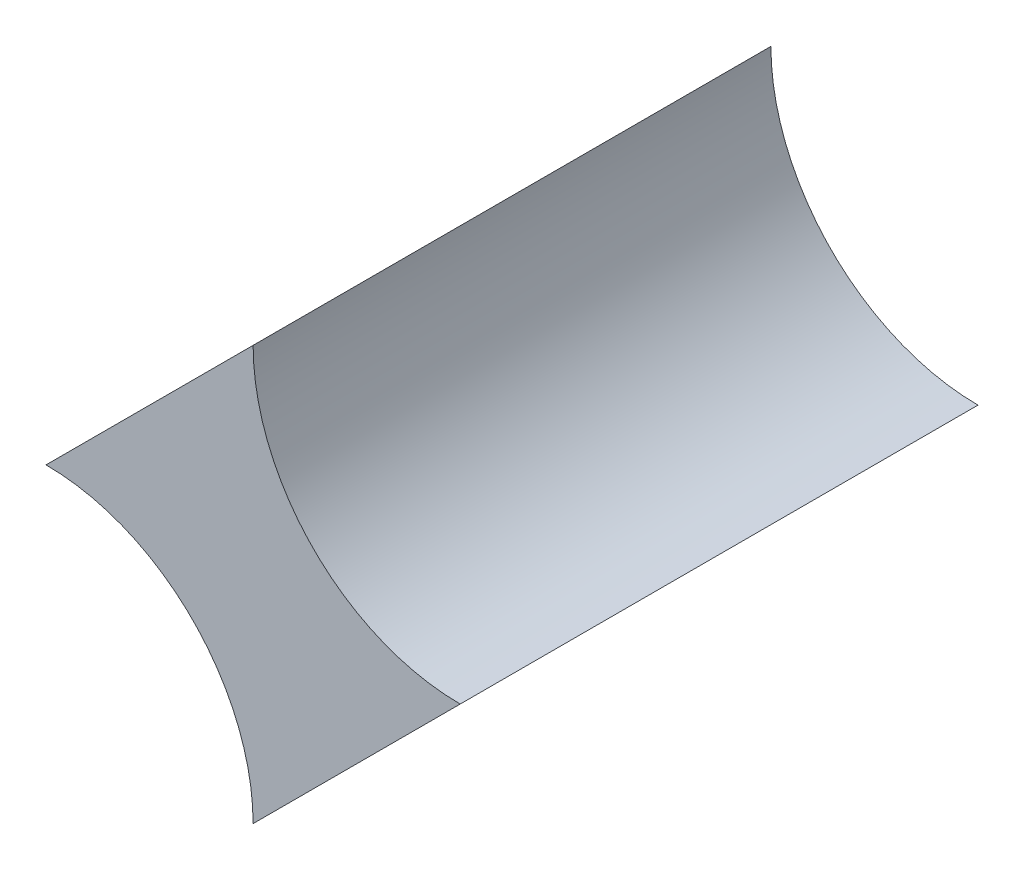
ISO-10303-21;
HEADER;
FILE_DESCRIPTION(('STEP AP214'),'2;1');
FILE_NAME('part.step','',(''),(''),'','','');
FILE_SCHEMA(('AUTOMOTIVE_DESIGN { 1 0 10303 214 1 1 1 1 }'));
ENDSEC;
DATA;
#1=APPLICATION_CONTEXT('core data for automotive mechanical design processes');
#2=APPLICATION_PROTOCOL_DEFINITION('international standard','automotive_design',2000,#1);
#3=PRODUCT_CONTEXT('',#1,'mechanical');
#4=PRODUCT('Part','Part','',(#3));
#5=PRODUCT_RELATED_PRODUCT_CATEGORY('part','',(#4));
#6=PRODUCT_DEFINITION_FORMATION('','',#4);
#7=PRODUCT_DEFINITION_CONTEXT('part definition',#1,'design');
#8=PRODUCT_DEFINITION('design','',#6,#7);
#9=PRODUCT_DEFINITION_SHAPE('','',#8);
#10=(LENGTH_UNIT() NAMED_UNIT(*) SI_UNIT(.MILLI.,.METRE.));
#11=(NAMED_UNIT(*) PLANE_ANGLE_UNIT() SI_UNIT($,.RADIAN.));
#12=(NAMED_UNIT(*) SI_UNIT($,.STERADIAN.) SOLID_ANGLE_UNIT());
#13=UNCERTAINTY_MEASURE_WITH_UNIT(LENGTH_MEASURE(1.E-05),#10,'distance_accuracy_value','');
#14=(GEOMETRIC_REPRESENTATION_CONTEXT(3) GLOBAL_UNCERTAINTY_ASSIGNED_CONTEXT((#13)) GLOBAL_UNIT_ASSIGNED_CONTEXT((#10,
#11,#12)) REPRESENTATION_CONTEXT('',''));
#15=CARTESIAN_POINT('',(0.,0.,0.));
#16=DIRECTION('',(0.,0.,1.));
#17=DIRECTION('',(1.,0.,0.));
#18=AXIS2_PLACEMENT_3D('',#15,#16,#17);
#19=CARTESIAN_POINT('',(-20.,-10.,25.));
#20=DIRECTION('',(0.,0.,-1.));
#21=DIRECTION('',(-1.,0.,0.));
#22=AXIS2_PLACEMENT_3D('',#19,#20,#21);
#23=CYLINDRICAL_SURFACE('',#22,10.);
#24=CARTESIAN_POINT('',(-20.,-10.,0.));
#25=DIRECTION('',(0.,0.,-1.));
#26=DIRECTION('',(-1.,0.,0.));
#27=AXIS2_PLACEMENT_3D('',#24,#25,#26);
#28=CIRCLE('',#27,10.);
#29=CARTESIAN_POINT('',(-20.,0.,0.));
#30=VERTEX_POINT('',#29);
#31=CARTESIAN_POINT('',(-10.,-10.,0.));
#32=VERTEX_POINT('',#31);
#33=EDGE_CURVE('E96',#30,#32,#28,.T.);
#34=ORIENTED_EDGE('',*,*,#33,.T.);
#35=DIRECTION('',(0.,0.,-1.));
#36=VECTOR('',#35,1.);
#37=CARTESIAN_POINT('',(-10.,-10.,25.));
#38=LINE('',#37,#36);
#39=CARTESIAN_POINT('',(-10.,-10.,25.));
#40=VERTEX_POINT('',#39);
#41=EDGE_CURVE('E11',#40,#32,#38,.T.);
#42=ORIENTED_EDGE('',*,*,#41,.F.);
#43=CARTESIAN_POINT('',(-20.,-10.,25.));
#44=DIRECTION('',(0.,0.,-1.));
#45=DIRECTION('',(-1.,0.,0.));
#46=AXIS2_PLACEMENT_3D('',#43,#44,#45);
#47=CIRCLE('',#46,10.);
#48=CARTESIAN_POINT('',(-20.,0.,25.));
#49=VERTEX_POINT('',#48);
#50=EDGE_CURVE('E84',#49,#40,#47,.T.);
#51=ORIENTED_EDGE('',*,*,#50,.F.);
#52=DIRECTION('',(0.,0.,-1.));
#53=VECTOR('',#52,1.);
#54=CARTESIAN_POINT('',(-20.,0.,25.));
#55=LINE('',#54,#53);
#56=EDGE_CURVE('E92',#49,#30,#55,.T.);
#57=ORIENTED_EDGE('',*,*,#56,.T.);
#58=EDGE_LOOP('',(#34,#42,#51,#57));
#59=FACE_BOUND('',#58,.T.);
#60=ADVANCED_FACE('F33',(#59),#23,.F.);
#61=CARTESIAN_POINT('',(-10.,-10.,25.));
#62=DIRECTION('',(-0.707106781186547,0.707106781186548,0.));
#63=DIRECTION('',(-0.707106781186548,-0.707106781186547,0.));
#64=AXIS2_PLACEMENT_3D('',#61,#62,#63);
#65=PLANE('',#64);
#66=DIRECTION('',(0.707106781186548,0.707106781186547,0.));
#67=VECTOR('',#66,1.);
#68=CARTESIAN_POINT('',(-10.,-10.,0.));
#69=LINE('',#68,#67);
#70=CARTESIAN_POINT('',(0.,0.,0.));
#71=VERTEX_POINT('',#70);
#72=EDGE_CURVE('E88',#32,#71,#69,.T.);
#73=ORIENTED_EDGE('',*,*,#72,.T.);
#74=DIRECTION('',(0.,0.,-1.));
#75=VECTOR('',#74,1.);
#76=CARTESIAN_POINT('',(0.,0.,25.));
#77=LINE('',#76,#75);
#78=CARTESIAN_POINT('',(0.,0.,25.));
#79=VERTEX_POINT('',#78);
#80=EDGE_CURVE('E41',#79,#71,#77,.T.);
#81=ORIENTED_EDGE('',*,*,#80,.F.);
#82=DIRECTION('',(0.707106781186548,0.707106781186547,0.));
#83=VECTOR('',#82,1.);
#84=CARTESIAN_POINT('',(-10.,-10.,25.));
#85=LINE('',#84,#83);
#86=EDGE_CURVE('E79',#40,#79,#85,.T.);
#87=ORIENTED_EDGE('',*,*,#86,.F.);
#88=ORIENTED_EDGE('',*,*,#41,.T.);
#89=EDGE_LOOP('',(#73,#81,#87,#88));
#90=FACE_BOUND('',#89,.T.);
#91=ADVANCED_FACE('F87',(#90),#65,.F.);
#92=CARTESIAN_POINT('',(0.,10.,25.));
#93=DIRECTION('',(0.,0.,-1.));
#94=DIRECTION('',(-1.,0.,0.));
#95=AXIS2_PLACEMENT_3D('',#92,#93,#94);
#96=CYLINDRICAL_SURFACE('',#95,10.);
#97=CARTESIAN_POINT('',(0.,10.,0.));
#98=DIRECTION('',(0.,0.,-1.));
#99=DIRECTION('',(1.,0.,0.));
#100=AXIS2_PLACEMENT_3D('',#97,#98,#99);
#101=CIRCLE('',#100,10.);
#102=CARTESIAN_POINT('',(-10.,10.,0.));
#103=VERTEX_POINT('',#102);
#104=EDGE_CURVE('E66',#71,#103,#101,.T.);
#105=ORIENTED_EDGE('',*,*,#104,.T.);
#106=DIRECTION('',(0.,0.,-1.));
#107=VECTOR('',#106,1.);
#108=CARTESIAN_POINT('',(-10.,10.,25.));
#109=LINE('',#108,#107);
#110=CARTESIAN_POINT('',(-10.,10.,25.));
#111=VERTEX_POINT('',#110);
#112=EDGE_CURVE('E89',#111,#103,#109,.T.);
#113=ORIENTED_EDGE('',*,*,#112,.F.);
#114=CARTESIAN_POINT('',(0.,10.,25.));
#115=DIRECTION('',(0.,0.,-1.));
#116=DIRECTION('',(1.,0.,0.));
#117=AXIS2_PLACEMENT_3D('',#114,#115,#116);
#118=CIRCLE('',#117,10.);
#119=EDGE_CURVE('E82',#79,#111,#118,.T.);
#120=ORIENTED_EDGE('',*,*,#119,.F.);
#121=ORIENTED_EDGE('',*,*,#80,.T.);
#122=EDGE_LOOP('',(#105,#113,#120,#121));
#123=FACE_BOUND('',#122,.T.);
#124=ADVANCED_FACE('F90',(#123),#96,.F.);
#125=CARTESIAN_POINT('',(-20.,0.,25.));
#126=DIRECTION('',(0.707106781186547,-0.707106781186548,0.));
#127=DIRECTION('',(0.707106781186548,0.707106781186547,0.));
#128=AXIS2_PLACEMENT_3D('',#125,#126,#127);
#129=PLANE('',#128);
#130=DIRECTION('',(-0.707106781186548,-0.707106781186547,0.));
#131=VECTOR('',#130,1.);
#132=CARTESIAN_POINT('',(-20.,0.,0.));
#133=LINE('',#132,#131);
#134=EDGE_CURVE('E72',#103,#30,#133,.T.);
#135=ORIENTED_EDGE('',*,*,#134,.T.);
#136=ORIENTED_EDGE('',*,*,#56,.F.);
#137=DIRECTION('',(-0.707106781186548,-0.707106781186547,0.));
#138=VECTOR('',#137,1.);
#139=CARTESIAN_POINT('',(-20.,0.,25.));
#140=LINE('',#139,#138);
#141=EDGE_CURVE('E49',#111,#49,#140,.T.);
#142=ORIENTED_EDGE('',*,*,#141,.F.);
#143=ORIENTED_EDGE('',*,*,#112,.T.);
#144=EDGE_LOOP('',(#135,#136,#142,#143));
#145=FACE_BOUND('',#144,.T.);
#146=ADVANCED_FACE('F103',(#145),#129,.F.);
#147=CARTESIAN_POINT('',(-20.,-10.,25.));
#148=DIRECTION('',(0.,0.,-1.));
#149=DIRECTION('',(-1.,0.,0.));
#150=AXIS2_PLACEMENT_3D('',#147,#148,#149);
#151=PLANE('',#150);
#152=ORIENTED_EDGE('',*,*,#50,.T.);
#153=ORIENTED_EDGE('',*,*,#86,.T.);
#154=ORIENTED_EDGE('',*,*,#119,.T.);
#155=ORIENTED_EDGE('',*,*,#141,.T.);
#156=EDGE_LOOP('',(#152,#153,#154,#155));
#157=FACE_BOUND('',#156,.T.);
#158=ADVANCED_FACE('F80',(#157),#151,.F.);
#159=CARTESIAN_POINT('',(-20.,-10.,0.));
#160=DIRECTION('',(0.,0.,-1.));
#161=DIRECTION('',(-1.,0.,0.));
#162=AXIS2_PLACEMENT_3D('',#159,#160,#161);
#163=PLANE('',#162);
#164=ORIENTED_EDGE('',*,*,#33,.F.);
#165=ORIENTED_EDGE('',*,*,#134,.F.);
#166=ORIENTED_EDGE('',*,*,#104,.F.);
#167=ORIENTED_EDGE('',*,*,#72,.F.);
#168=EDGE_LOOP('',(#164,#165,#166,#167));
#169=FACE_BOUND('',#168,.T.);
#170=ADVANCED_FACE('F106',(#169),#163,.T.);
#171=CLOSED_SHELL('',(#60,#91,#124,#146,#158,#170));
#172=MANIFOLD_SOLID_BREP('B2',#171);
#173=ADVANCED_BREP_SHAPE_REPRESENTATION('',(#18,#172),#14);
#174=SHAPE_DEFINITION_REPRESENTATION(#9,#173);
ENDSEC;
END-ISO-10303-21;
